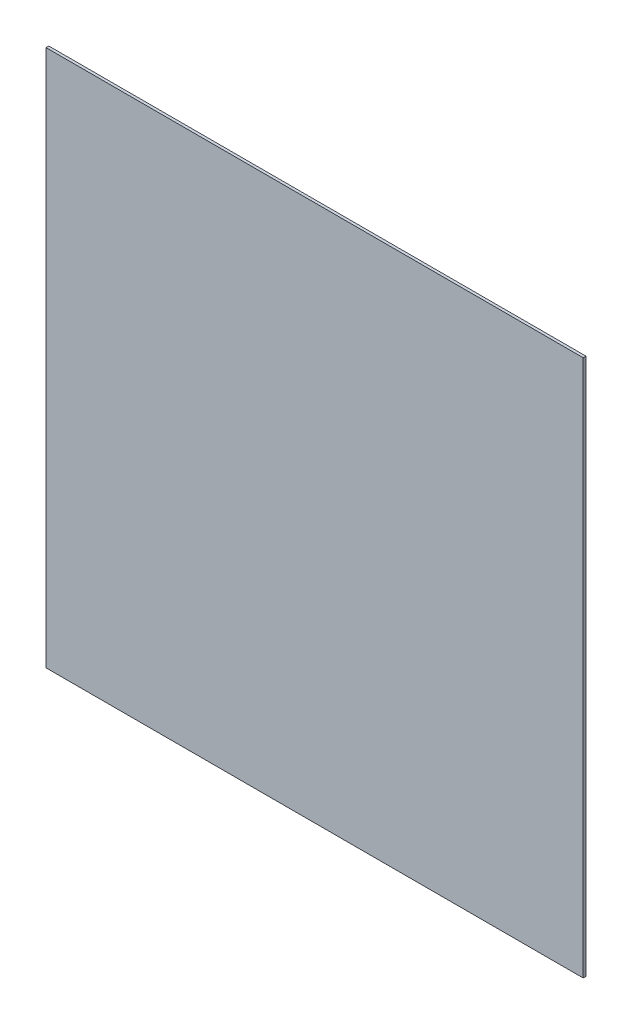
ISO-10303-21;
HEADER;
FILE_DESCRIPTION(('STEP AP214'),'2;1');
FILE_NAME('part.step','',(''),(''),'','','');
FILE_SCHEMA(('AUTOMOTIVE_DESIGN { 1 0 10303 214 1 1 1 1 }'));
ENDSEC;
DATA;
#1=APPLICATION_CONTEXT('core data for automotive mechanical design processes');
#2=APPLICATION_PROTOCOL_DEFINITION('international standard','automotive_design',2000,#1);
#3=PRODUCT_CONTEXT('',#1,'mechanical');
#4=PRODUCT('Part','Part','',(#3));
#5=PRODUCT_RELATED_PRODUCT_CATEGORY('part','',(#4));
#6=PRODUCT_DEFINITION_FORMATION('','',#4);
#7=PRODUCT_DEFINITION_CONTEXT('part definition',#1,'design');
#8=PRODUCT_DEFINITION('design','',#6,#7);
#9=PRODUCT_DEFINITION_SHAPE('','',#8);
#10=(LENGTH_UNIT() NAMED_UNIT(*) SI_UNIT(.MILLI.,.METRE.));
#11=(NAMED_UNIT(*) PLANE_ANGLE_UNIT() SI_UNIT($,.RADIAN.));
#12=(NAMED_UNIT(*) SI_UNIT($,.STERADIAN.) SOLID_ANGLE_UNIT());
#13=UNCERTAINTY_MEASURE_WITH_UNIT(LENGTH_MEASURE(1.E-05),#10,'distance_accuracy_value','');
#14=(GEOMETRIC_REPRESENTATION_CONTEXT(3) GLOBAL_UNCERTAINTY_ASSIGNED_CONTEXT((#13)) GLOBAL_UNIT_ASSIGNED_CONTEXT((#10,
#11,#12)) REPRESENTATION_CONTEXT('',''));
#15=CARTESIAN_POINT('',(0.,0.,0.));
#16=DIRECTION('',(0.,0.,1.));
#17=DIRECTION('',(1.,0.,0.));
#18=AXIS2_PLACEMENT_3D('',#15,#16,#17);
#19=CARTESIAN_POINT('',(194.,194.,0.));
#20=DIRECTION('',(0.,0.,1.));
#21=DIRECTION('',(1.,0.,0.));
#22=AXIS2_PLACEMENT_3D('',#19,#20,#21);
#23=PLANE('',#22);
#24=DIRECTION('',(0.,1.,0.));
#25=VECTOR('',#24,1.);
#26=CARTESIAN_POINT('',(0.,388.,0.));
#27=LINE('',#26,#25);
#28=CARTESIAN_POINT('',(0.,388.,0.));
#29=VERTEX_POINT('',#28);
#30=CARTESIAN_POINT('',(0.,0.,0.));
#31=VERTEX_POINT('',#30);
#32=EDGE_CURVE('E87',#29,#31,#27,.F.);
#33=ORIENTED_EDGE('',*,*,#32,.F.);
#34=DIRECTION('',(1.,0.,0.));
#35=VECTOR('',#34,1.);
#36=CARTESIAN_POINT('',(388.,388.,0.));
#37=LINE('',#36,#35);
#38=CARTESIAN_POINT('',(388.,388.,0.));
#39=VERTEX_POINT('',#38);
#40=EDGE_CURVE('E56',#39,#29,#37,.F.);
#41=ORIENTED_EDGE('',*,*,#40,.F.);
#42=DIRECTION('',(0.,1.,0.));
#43=VECTOR('',#42,1.);
#44=CARTESIAN_POINT('',(388.,0.,0.));
#45=LINE('',#44,#43);
#46=CARTESIAN_POINT('',(388.,0.,0.));
#47=VERTEX_POINT('',#46);
#48=EDGE_CURVE('E58',#47,#39,#45,.T.);
#49=ORIENTED_EDGE('',*,*,#48,.F.);
#50=DIRECTION('',(1.,0.,0.));
#51=VECTOR('',#50,1.);
#52=CARTESIAN_POINT('',(0.,0.,0.));
#53=LINE('',#52,#51);
#54=EDGE_CURVE('E20',#31,#47,#53,.T.);
#55=ORIENTED_EDGE('',*,*,#54,.F.);
#56=EDGE_LOOP('',(#33,#41,#49,#55));
#57=FACE_BOUND('',#56,.T.);
#58=ADVANCED_FACE('F17',(#57),#23,.F.);
#59=CARTESIAN_POINT('',(0.,0.,0.));
#60=DIRECTION('',(0.,-1.,0.));
#61=DIRECTION('',(0.,0.,-1.));
#62=AXIS2_PLACEMENT_3D('',#59,#60,#61);
#63=PLANE('',#62);
#64=DIRECTION('',(1.,0.,0.));
#65=VECTOR('',#64,1.);
#66=CARTESIAN_POINT('',(194.,0.,2.));
#67=LINE('',#66,#65);
#68=CARTESIAN_POINT('',(0.,0.,2.));
#69=VERTEX_POINT('',#68);
#70=CARTESIAN_POINT('',(388.,0.,2.));
#71=VERTEX_POINT('',#70);
#72=EDGE_CURVE('E93',#69,#71,#67,.T.);
#73=ORIENTED_EDGE('',*,*,#72,.F.);
#74=DIRECTION('',(0.,0.,1.));
#75=VECTOR('',#74,1.);
#76=CARTESIAN_POINT('',(0.,0.,0.));
#77=LINE('',#76,#75);
#78=EDGE_CURVE('E70',#31,#69,#77,.T.);
#79=ORIENTED_EDGE('',*,*,#78,.F.);
#80=ORIENTED_EDGE('',*,*,#54,.T.);
#81=DIRECTION('',(0.,0.,-1.));
#82=VECTOR('',#81,1.);
#83=CARTESIAN_POINT('',(388.,0.,0.));
#84=LINE('',#83,#82);
#85=EDGE_CURVE('E65',#71,#47,#84,.T.);
#86=ORIENTED_EDGE('',*,*,#85,.F.);
#87=EDGE_LOOP('',(#73,#79,#80,#86));
#88=FACE_BOUND('',#87,.T.);
#89=ADVANCED_FACE('F67',(#88),#63,.T.);
#90=CARTESIAN_POINT('',(388.,0.,0.));
#91=DIRECTION('',(1.,0.,0.));
#92=DIRECTION('',(0.,0.,-1.));
#93=AXIS2_PLACEMENT_3D('',#90,#91,#92);
#94=PLANE('',#93);
#95=DIRECTION('',(0.,1.,0.));
#96=VECTOR('',#95,1.);
#97=CARTESIAN_POINT('',(388.,194.,2.));
#98=LINE('',#97,#96);
#99=CARTESIAN_POINT('',(388.,388.,2.));
#100=VERTEX_POINT('',#99);
#101=EDGE_CURVE('E75',#71,#100,#98,.T.);
#102=ORIENTED_EDGE('',*,*,#101,.F.);
#103=ORIENTED_EDGE('',*,*,#85,.T.);
#104=ORIENTED_EDGE('',*,*,#48,.T.);
#105=DIRECTION('',(0.,0.,1.));
#106=VECTOR('',#105,1.);
#107=CARTESIAN_POINT('',(388.,388.,0.));
#108=LINE('',#107,#106);
#109=EDGE_CURVE('E82',#100,#39,#108,.F.);
#110=ORIENTED_EDGE('',*,*,#109,.F.);
#111=EDGE_LOOP('',(#102,#103,#104,#110));
#112=FACE_BOUND('',#111,.T.);
#113=ADVANCED_FACE('F73',(#112),#94,.T.);
#114=CARTESIAN_POINT('',(388.,388.,0.));
#115=DIRECTION('',(0.,1.,0.));
#116=DIRECTION('',(0.,0.,1.));
#117=AXIS2_PLACEMENT_3D('',#114,#115,#116);
#118=PLANE('',#117);
#119=DIRECTION('',(1.,0.,0.));
#120=VECTOR('',#119,1.);
#121=CARTESIAN_POINT('',(194.,388.,2.));
#122=LINE('',#121,#120);
#123=CARTESIAN_POINT('',(0.,388.,2.));
#124=VERTEX_POINT('',#123);
#125=EDGE_CURVE('E27',#100,#124,#122,.F.);
#126=ORIENTED_EDGE('',*,*,#125,.F.);
#127=ORIENTED_EDGE('',*,*,#109,.T.);
#128=ORIENTED_EDGE('',*,*,#40,.T.);
#129=DIRECTION('',(0.,0.,1.));
#130=VECTOR('',#129,1.);
#131=CARTESIAN_POINT('',(0.,388.,0.));
#132=LINE('',#131,#130);
#133=EDGE_CURVE('E36',#124,#29,#132,.F.);
#134=ORIENTED_EDGE('',*,*,#133,.F.);
#135=EDGE_LOOP('',(#126,#127,#128,#134));
#136=FACE_BOUND('',#135,.T.);
#137=ADVANCED_FACE('F102',(#136),#118,.T.);
#138=CARTESIAN_POINT('',(0.,388.,0.));
#139=DIRECTION('',(-1.,0.,0.));
#140=DIRECTION('',(0.,0.,1.));
#141=AXIS2_PLACEMENT_3D('',#138,#139,#140);
#142=PLANE('',#141);
#143=DIRECTION('',(0.,1.,0.));
#144=VECTOR('',#143,1.);
#145=CARTESIAN_POINT('',(0.,194.,2.));
#146=LINE('',#145,#144);
#147=EDGE_CURVE('E11',#124,#69,#146,.F.);
#148=ORIENTED_EDGE('',*,*,#147,.F.);
#149=ORIENTED_EDGE('',*,*,#133,.T.);
#150=ORIENTED_EDGE('',*,*,#32,.T.);
#151=ORIENTED_EDGE('',*,*,#78,.T.);
#152=EDGE_LOOP('',(#148,#149,#150,#151));
#153=FACE_BOUND('',#152,.T.);
#154=ADVANCED_FACE('F104',(#153),#142,.T.);
#155=CARTESIAN_POINT('',(194.,194.,2.));
#156=DIRECTION('',(0.,0.,1.));
#157=DIRECTION('',(1.,0.,0.));
#158=AXIS2_PLACEMENT_3D('',#155,#156,#157);
#159=PLANE('',#158);
#160=ORIENTED_EDGE('',*,*,#125,.T.);
#161=ORIENTED_EDGE('',*,*,#147,.T.);
#162=ORIENTED_EDGE('',*,*,#72,.T.);
#163=ORIENTED_EDGE('',*,*,#101,.T.);
#164=EDGE_LOOP('',(#160,#161,#162,#163));
#165=FACE_BOUND('',#164,.T.);
#166=ADVANCED_FACE('F101',(#165),#159,.T.);
#167=CLOSED_SHELL('',(#58,#89,#113,#137,#154,#166));
#168=MANIFOLD_SOLID_BREP('B1',#167);
#169=ADVANCED_BREP_SHAPE_REPRESENTATION('',(#18,#168),#14);
#170=SHAPE_DEFINITION_REPRESENTATION(#9,#169);
ENDSEC;
END-ISO-10303-21;
